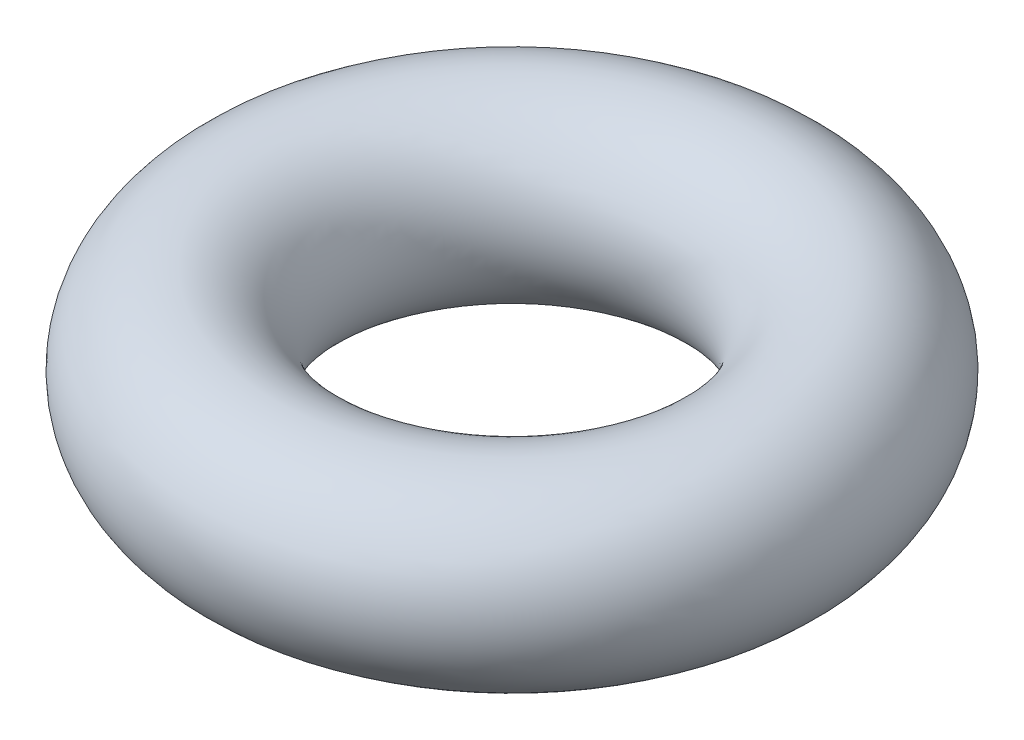
ISO-10303-21;
HEADER;
FILE_DESCRIPTION(('STEP AP214'),'2;1');
FILE_NAME('part.step','',(''),(''),'','','');
FILE_SCHEMA(('AUTOMOTIVE_DESIGN { 1 0 10303 214 1 1 1 1 }'));
ENDSEC;
DATA;
#1=APPLICATION_CONTEXT('core data for automotive mechanical design processes');
#2=APPLICATION_PROTOCOL_DEFINITION('international standard','automotive_design',2000,#1);
#3=PRODUCT_CONTEXT('',#1,'mechanical');
#4=PRODUCT('Part','Part','',(#3));
#5=PRODUCT_RELATED_PRODUCT_CATEGORY('part','',(#4));
#6=PRODUCT_DEFINITION_FORMATION('','',#4);
#7=PRODUCT_DEFINITION_CONTEXT('part definition',#1,'design');
#8=PRODUCT_DEFINITION('design','',#6,#7);
#9=PRODUCT_DEFINITION_SHAPE('','',#8);
#10=(LENGTH_UNIT() NAMED_UNIT(*) SI_UNIT(.MILLI.,.METRE.));
#11=(NAMED_UNIT(*) PLANE_ANGLE_UNIT() SI_UNIT($,.RADIAN.));
#12=(NAMED_UNIT(*) SI_UNIT($,.STERADIAN.) SOLID_ANGLE_UNIT());
#13=UNCERTAINTY_MEASURE_WITH_UNIT(LENGTH_MEASURE(1.E-05),#10,'distance_accuracy_value','');
#14=(GEOMETRIC_REPRESENTATION_CONTEXT(3) GLOBAL_UNCERTAINTY_ASSIGNED_CONTEXT((#13)) GLOBAL_UNIT_ASSIGNED_CONTEXT((#10,
#11,#12)) REPRESENTATION_CONTEXT('',''));
#15=CARTESIAN_POINT('',(0.,0.,0.));
#16=DIRECTION('',(0.,0.,1.));
#17=DIRECTION('',(1.,0.,0.));
#18=AXIS2_PLACEMENT_3D('',#15,#16,#17);
#19=CARTESIAN_POINT('',(0.,0.,0.));
#20=DIRECTION('',(0.,-1.,0.));
#21=DIRECTION('',(0.,0.,-1.));
#22=AXIS2_PLACEMENT_3D('',#19,#20,#21);
#23=TOROIDAL_SURFACE('',#22,2.3368,0.889);
#24=CARTESIAN_POINT('',(0.,0.,-3.2258));
#25=VERTEX_POINT('',#24);
#26=VERTEX_LOOP('',#25);
#27=FACE_BOUND('',#26,.T.);
#28=ADVANCED_FACE('F34',(#27),#23,.T.);
#29=CLOSED_SHELL('',(#28));
#30=MANIFOLD_SOLID_BREP('B2',#29);
#31=ADVANCED_BREP_SHAPE_REPRESENTATION('',(#18,#30),#14);
#32=SHAPE_DEFINITION_REPRESENTATION(#9,#31);
ENDSEC;
END-ISO-10303-21;
